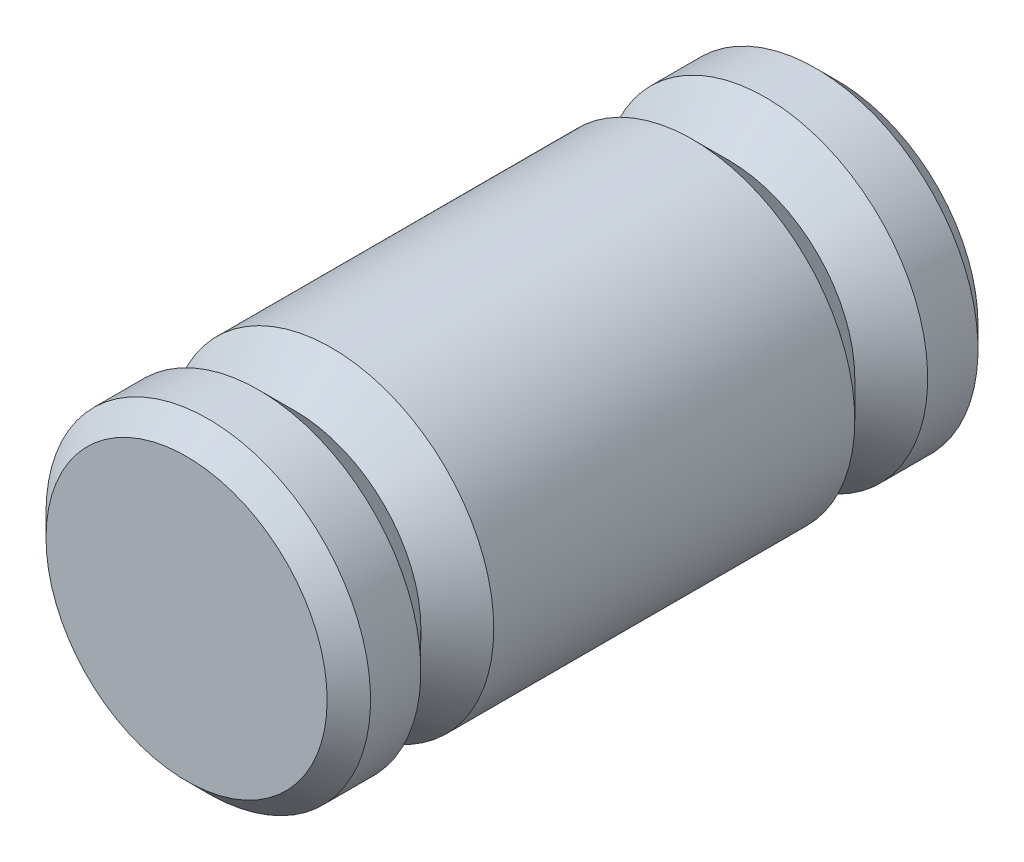
ISO-10303-21;
HEADER;
FILE_DESCRIPTION(('STEP AP214'),'2;1');
FILE_NAME('part.step','',(''),(''),'','','');
FILE_SCHEMA(('AUTOMOTIVE_DESIGN { 1 0 10303 214 1 1 1 1 }'));
ENDSEC;
DATA;
#1=APPLICATION_CONTEXT('core data for automotive mechanical design processes');
#2=APPLICATION_PROTOCOL_DEFINITION('international standard','automotive_design',2000,#1);
#3=PRODUCT_CONTEXT('',#1,'mechanical');
#4=PRODUCT('Part','Part','',(#3));
#5=PRODUCT_RELATED_PRODUCT_CATEGORY('part','',(#4));
#6=PRODUCT_DEFINITION_FORMATION('','',#4);
#7=PRODUCT_DEFINITION_CONTEXT('part definition',#1,'design');
#8=PRODUCT_DEFINITION('design','',#6,#7);
#9=PRODUCT_DEFINITION_SHAPE('','',#8);
#10=(LENGTH_UNIT() NAMED_UNIT(*) SI_UNIT(.MILLI.,.METRE.));
#11=(NAMED_UNIT(*) PLANE_ANGLE_UNIT() SI_UNIT($,.RADIAN.));
#12=(NAMED_UNIT(*) SI_UNIT($,.STERADIAN.) SOLID_ANGLE_UNIT());
#13=UNCERTAINTY_MEASURE_WITH_UNIT(LENGTH_MEASURE(1.E-05),#10,'distance_accuracy_value','');
#14=(GEOMETRIC_REPRESENTATION_CONTEXT(3) GLOBAL_UNCERTAINTY_ASSIGNED_CONTEXT((#13)) GLOBAL_UNIT_ASSIGNED_CONTEXT((#10,
#11,#12)) REPRESENTATION_CONTEXT('',''));
#15=CARTESIAN_POINT('',(0.,0.,0.));
#16=DIRECTION('',(0.,0.,1.));
#17=DIRECTION('',(1.,0.,0.));
#18=AXIS2_PLACEMENT_3D('',#15,#16,#17);
#19=CARTESIAN_POINT('',(22.4599499999992,-7.21644966006352E-13,24.8644631571219));
#20=DIRECTION('',(0.,0.,-1.));
#21=DIRECTION('',(-1.,0.,0.));
#22=AXIS2_PLACEMENT_3D('',#19,#20,#21);
#23=CYLINDRICAL_SURFACE('',#22,4.74980000000098);
#24=CARTESIAN_POINT('',(22.4599499999992,-7.21644966006352E-13,2.54));
#25=DIRECTION('',(0.,0.,-1.));
#26=DIRECTION('',(-1.,0.,0.));
#27=AXIS2_PLACEMENT_3D('',#24,#25,#26);
#28=CIRCLE('',#27,4.74980000000098);
#29=CARTESIAN_POINT('',(17.7101499999982,-7.21644966006352E-13,2.54));
#30=VERTEX_POINT('',#29);
#31=EDGE_CURVE('E10',#30,#30,#28,.F.);
#32=ORIENTED_EDGE('',*,*,#31,.T.);
#33=EDGE_LOOP('',(#32));
#34=FACE_BOUND('',#33,.T.);
#35=CARTESIAN_POINT('',(22.4599499999992,0.,4.01319999999902));
#36=DIRECTION('',(0.,0.,-1.));
#37=DIRECTION('',(-1.,0.,0.));
#38=AXIS2_PLACEMENT_3D('',#35,#36,#37);
#39=CIRCLE('',#38,4.74980000000098);
#40=CARTESIAN_POINT('',(17.7101499999982,0.,4.01319999999902));
#41=VERTEX_POINT('',#40);
#42=EDGE_CURVE('E40',#41,#41,#39,.F.);
#43=ORIENTED_EDGE('',*,*,#42,.F.);
#44=EDGE_LOOP('',(#43));
#45=FACE_BOUND('',#44,.T.);
#46=ADVANCED_FACE('F29',(#34,#45),#23,.T.);
#47=CARTESIAN_POINT('',(22.4599499999992,0.,5.08));
#48=DIRECTION('',(0.,0.,-1.));
#49=DIRECTION('',(-1.,0.,0.));
#50=AXIS2_PLACEMENT_3D('',#47,#48,#49);
#51=CONICAL_SURFACE('',#50,3.683,0.785398163397448);
#52=CARTESIAN_POINT('',(22.4599499999992,0.,5.08));
#53=DIRECTION('',(0.,0.,1.));
#54=DIRECTION('',(1.,0.,0.));
#55=AXIS2_PLACEMENT_3D('',#52,#53,#54);
#56=CIRCLE('',#55,3.683);
#57=CARTESIAN_POINT('',(26.1429499999992,0.,5.08));
#58=VERTEX_POINT('',#57);
#59=EDGE_CURVE('E49',#58,#58,#56,.T.);
#60=ORIENTED_EDGE('',*,*,#59,.F.);
#61=EDGE_LOOP('',(#60));
#62=FACE_BOUND('',#61,.T.);
#63=ORIENTED_EDGE('',*,*,#42,.T.);
#64=EDGE_LOOP('',(#63));
#65=FACE_BOUND('',#64,.T.);
#66=ADVANCED_FACE('F88',(#62,#65),#51,.T.);
#67=CARTESIAN_POINT('',(22.4599499999992,0.,6.985));
#68=DIRECTION('',(0.,0.,1.));
#69=DIRECTION('',(1.,0.,0.));
#70=AXIS2_PLACEMENT_3D('',#67,#68,#69);
#71=CONICAL_SURFACE('',#70,5.588,0.785398163397449);
#72=ORIENTED_EDGE('',*,*,#59,.T.);
#73=EDGE_LOOP('',(#72));
#74=FACE_BOUND('',#73,.T.);
#75=CARTESIAN_POINT('',(22.4599499999992,0.,6.14680000000098));
#76=DIRECTION('',(0.,0.,1.));
#77=DIRECTION('',(1.,0.,0.));
#78=AXIS2_PLACEMENT_3D('',#75,#76,#77);
#79=CIRCLE('',#78,4.74980000000098);
#80=CARTESIAN_POINT('',(27.2097500000002,0.,6.14680000000098));
#81=VERTEX_POINT('',#80);
#82=EDGE_CURVE('E44',#81,#81,#79,.F.);
#83=ORIENTED_EDGE('',*,*,#82,.T.);
#84=EDGE_LOOP('',(#83));
#85=FACE_BOUND('',#84,.T.);
#86=ADVANCED_FACE('F81',(#74,#85),#71,.T.);
#87=ORIENTED_EDGE('',*,*,#82,.F.);
#88=EDGE_LOOP('',(#87));
#89=FACE_BOUND('',#88,.T.);
#90=CARTESIAN_POINT('',(22.4599499999992,0.,16.713199999999));
#91=DIRECTION('',(0.,0.,1.));
#92=DIRECTION('',(1.,0.,0.));
#93=AXIS2_PLACEMENT_3D('',#90,#91,#92);
#94=CIRCLE('',#93,4.74980000000098);
#95=CARTESIAN_POINT('',(27.2097500000002,0.,16.713199999999));
#96=VERTEX_POINT('',#95);
#97=EDGE_CURVE('E61',#96,#96,#94,.F.);
#98=ORIENTED_EDGE('',*,*,#97,.T.);
#99=EDGE_LOOP('',(#98));
#100=FACE_BOUND('',#99,.T.);
#101=ADVANCED_FACE('F78',(#89,#100),#23,.T.);
#102=CARTESIAN_POINT('',(22.4599499999992,-7.21644966006352E-13,1.905));
#103=DIRECTION('',(0.,0.,-1.));
#104=DIRECTION('',(-1.,0.,0.));
#105=AXIS2_PLACEMENT_3D('',#102,#103,#104);
#106=PLANE('',#105);
#107=CARTESIAN_POINT('',(22.4599499999992,-7.21644966006352E-13,1.905));
#108=DIRECTION('',(0.,0.,-1.));
#109=DIRECTION('',(-1.,0.,0.));
#110=AXIS2_PLACEMENT_3D('',#107,#108,#109);
#111=CIRCLE('',#110,4.11480000000098);
#112=CARTESIAN_POINT('',(18.3451499999982,-7.21644966006352E-13,1.905));
#113=VERTEX_POINT('',#112);
#114=EDGE_CURVE('E36',#113,#113,#111,.T.);
#115=ORIENTED_EDGE('',*,*,#114,.T.);
#116=EDGE_LOOP('',(#115));
#117=FACE_BOUND('',#116,.T.);
#118=ADVANCED_FACE('F80',(#117),#106,.T.);
#119=CARTESIAN_POINT('',(22.4599499999992,-7.21644966006352E-13,1.905));
#120=DIRECTION('',(0.,0.,1.));
#121=DIRECTION('',(1.,0.,0.));
#122=AXIS2_PLACEMENT_3D('',#119,#120,#121);
#123=CONICAL_SURFACE('',#122,4.11480000000098,0.785398163397444);
#124=ORIENTED_EDGE('',*,*,#31,.F.);
#125=EDGE_LOOP('',(#124));
#126=FACE_BOUND('',#125,.T.);
#127=ORIENTED_EDGE('',*,*,#114,.F.);
#128=EDGE_LOOP('',(#127));
#129=FACE_BOUND('',#128,.T.);
#130=ADVANCED_FACE('F31',(#126,#129),#123,.T.);
#131=CARTESIAN_POINT('',(22.4599499999992,-7.21644966006352E-13,-2.00446315712189));
#132=DIRECTION('',(0.,0.,1.));
#133=DIRECTION('',(-1.,0.,0.));
#134=AXIS2_PLACEMENT_3D('',#131,#132,#133);
#135=CYLINDRICAL_SURFACE('',#134,4.74980000000098);
#136=CARTESIAN_POINT('',(22.4599499999992,-7.21644966006352E-13,20.32));
#137=DIRECTION('',(0.,0.,-1.));
#138=DIRECTION('',(-1.,0.,0.));
#139=AXIS2_PLACEMENT_3D('',#136,#137,#138);
#140=CIRCLE('',#139,4.74980000000098);
#141=CARTESIAN_POINT('',(17.7101499999982,-7.21644966006352E-13,20.32));
#142=VERTEX_POINT('',#141);
#143=EDGE_CURVE('E52',#142,#142,#140,.F.);
#144=ORIENTED_EDGE('',*,*,#143,.F.);
#145=EDGE_LOOP('',(#144));
#146=FACE_BOUND('',#145,.T.);
#147=CARTESIAN_POINT('',(22.4599499999992,0.,18.846800000001));
#148=DIRECTION('',(0.,0.,-1.));
#149=DIRECTION('',(-1.,0.,0.));
#150=AXIS2_PLACEMENT_3D('',#147,#148,#149);
#151=CIRCLE('',#150,4.74980000000098);
#152=CARTESIAN_POINT('',(17.7101499999982,0.,18.846800000001));
#153=VERTEX_POINT('',#152);
#154=EDGE_CURVE('E58',#153,#153,#151,.F.);
#155=ORIENTED_EDGE('',*,*,#154,.T.);
#156=EDGE_LOOP('',(#155));
#157=FACE_BOUND('',#156,.T.);
#158=ADVANCED_FACE('F109',(#146,#157),#135,.T.);
#159=CARTESIAN_POINT('',(22.4599499999992,0.,17.78));
#160=DIRECTION('',(0.,0.,1.));
#161=DIRECTION('',(-1.,0.,0.));
#162=AXIS2_PLACEMENT_3D('',#159,#160,#161);
#163=CONICAL_SURFACE('',#162,3.683,0.785398163397448);
#164=CARTESIAN_POINT('',(22.4599499999992,0.,17.78));
#165=DIRECTION('',(0.,0.,1.));
#166=DIRECTION('',(1.,0.,0.));
#167=AXIS2_PLACEMENT_3D('',#164,#165,#166);
#168=CIRCLE('',#167,3.683);
#169=CARTESIAN_POINT('',(26.1429499999992,0.,17.78));
#170=VERTEX_POINT('',#169);
#171=EDGE_CURVE('E64',#170,#170,#168,.T.);
#172=ORIENTED_EDGE('',*,*,#171,.T.);
#173=EDGE_LOOP('',(#172));
#174=FACE_BOUND('',#173,.T.);
#175=ORIENTED_EDGE('',*,*,#154,.F.);
#176=EDGE_LOOP('',(#175));
#177=FACE_BOUND('',#176,.T.);
#178=ADVANCED_FACE('F68',(#174,#177),#163,.T.);
#179=CARTESIAN_POINT('',(22.4599499999992,0.,15.875));
#180=DIRECTION('',(0.,0.,-1.));
#181=DIRECTION('',(1.,0.,0.));
#182=AXIS2_PLACEMENT_3D('',#179,#180,#181);
#183=CONICAL_SURFACE('',#182,5.588,0.785398163397449);
#184=ORIENTED_EDGE('',*,*,#171,.F.);
#185=EDGE_LOOP('',(#184));
#186=FACE_BOUND('',#185,.T.);
#187=ORIENTED_EDGE('',*,*,#97,.F.);
#188=EDGE_LOOP('',(#187));
#189=FACE_BOUND('',#188,.T.);
#190=ADVANCED_FACE('F71',(#186,#189),#183,.T.);
#191=CARTESIAN_POINT('',(22.4599499999992,-7.21644966006352E-13,20.955));
#192=DIRECTION('',(0.,0.,1.));
#193=DIRECTION('',(-1.,0.,0.));
#194=AXIS2_PLACEMENT_3D('',#191,#192,#193);
#195=PLANE('',#194);
#196=CARTESIAN_POINT('',(22.4599499999992,-7.21644966006352E-13,20.955));
#197=DIRECTION('',(0.,0.,-1.));
#198=DIRECTION('',(-1.,0.,0.));
#199=AXIS2_PLACEMENT_3D('',#196,#197,#198);
#200=CIRCLE('',#199,4.11480000000098);
#201=CARTESIAN_POINT('',(18.3451499999982,-7.21644966006352E-13,20.955));
#202=VERTEX_POINT('',#201);
#203=EDGE_CURVE('E55',#202,#202,#200,.T.);
#204=ORIENTED_EDGE('',*,*,#203,.F.);
#205=EDGE_LOOP('',(#204));
#206=FACE_BOUND('',#205,.T.);
#207=ADVANCED_FACE('F74',(#206),#195,.T.);
#208=CARTESIAN_POINT('',(22.4599499999992,-7.21644966006352E-13,20.955));
#209=DIRECTION('',(0.,0.,-1.));
#210=DIRECTION('',(1.,0.,0.));
#211=AXIS2_PLACEMENT_3D('',#208,#209,#210);
#212=CONICAL_SURFACE('',#211,4.11480000000098,0.785398163397444);
#213=ORIENTED_EDGE('',*,*,#143,.T.);
#214=EDGE_LOOP('',(#213));
#215=FACE_BOUND('',#214,.T.);
#216=ORIENTED_EDGE('',*,*,#203,.T.);
#217=EDGE_LOOP('',(#216));
#218=FACE_BOUND('',#217,.T.);
#219=ADVANCED_FACE('F105',(#215,#218),#212,.T.);
#220=CLOSED_SHELL('',(#46,#66,#86,#101,#118,#130,#158,#178,#190,#207,#219));
#221=MANIFOLD_SOLID_BREP('B2',#220);
#222=ADVANCED_BREP_SHAPE_REPRESENTATION('',(#18,#221),#14);
#223=SHAPE_DEFINITION_REPRESENTATION(#9,#222);
ENDSEC;
END-ISO-10303-21;
